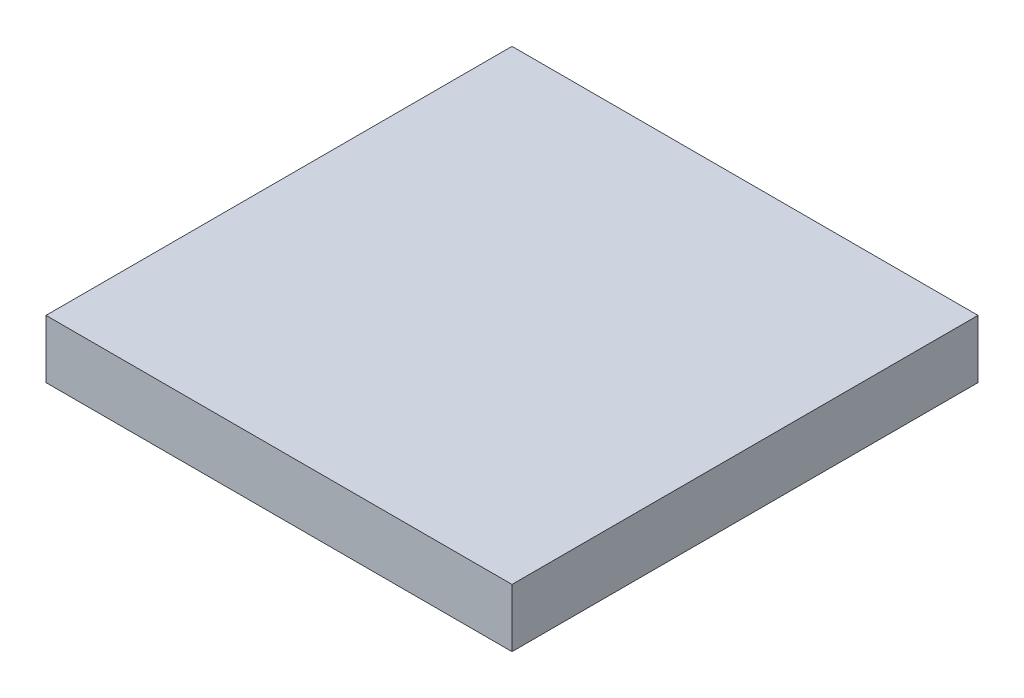
ISO-10303-21;
HEADER;
FILE_DESCRIPTION(('STEP AP214'),'2;1');
FILE_NAME('part.step','',(''),(''),'','','');
FILE_SCHEMA(('AUTOMOTIVE_DESIGN { 1 0 10303 214 1 1 1 1 }'));
ENDSEC;
DATA;
#1=APPLICATION_CONTEXT('core data for automotive mechanical design processes');
#2=APPLICATION_PROTOCOL_DEFINITION('international standard','automotive_design',2000,#1);
#3=PRODUCT_CONTEXT('',#1,'mechanical');
#4=PRODUCT('Part','Part','',(#3));
#5=PRODUCT_RELATED_PRODUCT_CATEGORY('part','',(#4));
#6=PRODUCT_DEFINITION_FORMATION('','',#4);
#7=PRODUCT_DEFINITION_CONTEXT('part definition',#1,'design');
#8=PRODUCT_DEFINITION('design','',#6,#7);
#9=PRODUCT_DEFINITION_SHAPE('','',#8);
#10=(LENGTH_UNIT() NAMED_UNIT(*) SI_UNIT(.MILLI.,.METRE.));
#11=(NAMED_UNIT(*) PLANE_ANGLE_UNIT() SI_UNIT($,.RADIAN.));
#12=(NAMED_UNIT(*) SI_UNIT($,.STERADIAN.) SOLID_ANGLE_UNIT());
#13=UNCERTAINTY_MEASURE_WITH_UNIT(LENGTH_MEASURE(1.E-05),#10,'distance_accuracy_value','');
#14=(GEOMETRIC_REPRESENTATION_CONTEXT(3) GLOBAL_UNCERTAINTY_ASSIGNED_CONTEXT((#13)) GLOBAL_UNIT_ASSIGNED_CONTEXT((#10,
#11,#12)) REPRESENTATION_CONTEXT('',''));
#15=CARTESIAN_POINT('',(0.,0.,0.));
#16=DIRECTION('',(0.,0.,1.));
#17=DIRECTION('',(1.,0.,0.));
#18=AXIS2_PLACEMENT_3D('',#15,#16,#17);
#19=CARTESIAN_POINT('',(10.16,2.54,-10.16));
#20=DIRECTION('',(-1.,0.,0.));
#21=DIRECTION('',(0.,0.,1.));
#22=AXIS2_PLACEMENT_3D('',#19,#20,#21);
#23=PLANE('',#22);
#24=DIRECTION('',(0.,0.,-1.));
#25=VECTOR('',#24,1.);
#26=CARTESIAN_POINT('',(10.16,0.,-10.16));
#27=LINE('',#26,#25);
#28=CARTESIAN_POINT('',(10.16,0.,10.16));
#29=VERTEX_POINT('',#28);
#30=CARTESIAN_POINT('',(10.16,0.,-10.16));
#31=VERTEX_POINT('',#30);
#32=EDGE_CURVE('E94',#29,#31,#27,.T.);
#33=ORIENTED_EDGE('',*,*,#32,.T.);
#34=DIRECTION('',(0.,-1.,0.));
#35=VECTOR('',#34,1.);
#36=CARTESIAN_POINT('',(10.16,2.54,-10.16));
#37=LINE('',#36,#35);
#38=CARTESIAN_POINT('',(10.16,2.54,-10.16));
#39=VERTEX_POINT('',#38);
#40=EDGE_CURVE('E11',#39,#31,#37,.T.);
#41=ORIENTED_EDGE('',*,*,#40,.F.);
#42=DIRECTION('',(0.,0.,-1.));
#43=VECTOR('',#42,1.);
#44=CARTESIAN_POINT('',(10.16,2.54,-10.16));
#45=LINE('',#44,#43);
#46=CARTESIAN_POINT('',(10.16,2.54,10.16));
#47=VERTEX_POINT('',#46);
#48=EDGE_CURVE('E82',#47,#39,#45,.T.);
#49=ORIENTED_EDGE('',*,*,#48,.F.);
#50=DIRECTION('',(0.,-1.,0.));
#51=VECTOR('',#50,1.);
#52=CARTESIAN_POINT('',(10.16,2.54,10.16));
#53=LINE('',#52,#51);
#54=EDGE_CURVE('E90',#47,#29,#53,.T.);
#55=ORIENTED_EDGE('',*,*,#54,.T.);
#56=EDGE_LOOP('',(#33,#41,#49,#55));
#57=FACE_BOUND('',#56,.T.);
#58=ADVANCED_FACE('F31',(#57),#23,.F.);
#59=CARTESIAN_POINT('',(-10.16,2.54,-10.16));
#60=DIRECTION('',(0.,0.,1.));
#61=DIRECTION('',(1.,0.,0.));
#62=AXIS2_PLACEMENT_3D('',#59,#60,#61);
#63=PLANE('',#62);
#64=DIRECTION('',(-1.,0.,0.));
#65=VECTOR('',#64,1.);
#66=CARTESIAN_POINT('',(-10.16,0.,-10.16));
#67=LINE('',#66,#65);
#68=CARTESIAN_POINT('',(-10.16,0.,-10.16));
#69=VERTEX_POINT('',#68);
#70=EDGE_CURVE('E86',#31,#69,#67,.T.);
#71=ORIENTED_EDGE('',*,*,#70,.T.);
#72=DIRECTION('',(0.,-1.,0.));
#73=VECTOR('',#72,1.);
#74=CARTESIAN_POINT('',(-10.16,2.54,-10.16));
#75=LINE('',#74,#73);
#76=CARTESIAN_POINT('',(-10.16,2.54,-10.16));
#77=VERTEX_POINT('',#76);
#78=EDGE_CURVE('E39',#77,#69,#75,.T.);
#79=ORIENTED_EDGE('',*,*,#78,.F.);
#80=DIRECTION('',(-1.,0.,0.));
#81=VECTOR('',#80,1.);
#82=CARTESIAN_POINT('',(-10.16,2.54,-10.16));
#83=LINE('',#82,#81);
#84=EDGE_CURVE('E77',#39,#77,#83,.T.);
#85=ORIENTED_EDGE('',*,*,#84,.F.);
#86=ORIENTED_EDGE('',*,*,#40,.T.);
#87=EDGE_LOOP('',(#71,#79,#85,#86));
#88=FACE_BOUND('',#87,.T.);
#89=ADVANCED_FACE('F85',(#88),#63,.F.);
#90=CARTESIAN_POINT('',(-10.16,2.54,-10.16));
#91=DIRECTION('',(1.,0.,0.));
#92=DIRECTION('',(0.,0.,-1.));
#93=AXIS2_PLACEMENT_3D('',#90,#91,#92);
#94=PLANE('',#93);
#95=DIRECTION('',(0.,0.,1.));
#96=VECTOR('',#95,1.);
#97=CARTESIAN_POINT('',(-10.16,0.,-10.16));
#98=LINE('',#97,#96);
#99=CARTESIAN_POINT('',(-10.16,0.,10.16));
#100=VERTEX_POINT('',#99);
#101=EDGE_CURVE('E64',#69,#100,#98,.T.);
#102=ORIENTED_EDGE('',*,*,#101,.T.);
#103=DIRECTION('',(0.,-1.,0.));
#104=VECTOR('',#103,1.);
#105=CARTESIAN_POINT('',(-10.16,2.54,10.16));
#106=LINE('',#105,#104);
#107=CARTESIAN_POINT('',(-10.16,2.54,10.16));
#108=VERTEX_POINT('',#107);
#109=EDGE_CURVE('E87',#108,#100,#106,.T.);
#110=ORIENTED_EDGE('',*,*,#109,.F.);
#111=DIRECTION('',(0.,0.,1.));
#112=VECTOR('',#111,1.);
#113=CARTESIAN_POINT('',(-10.16,2.54,-10.16));
#114=LINE('',#113,#112);
#115=EDGE_CURVE('E80',#77,#108,#114,.T.);
#116=ORIENTED_EDGE('',*,*,#115,.F.);
#117=ORIENTED_EDGE('',*,*,#78,.T.);
#118=EDGE_LOOP('',(#102,#110,#116,#117));
#119=FACE_BOUND('',#118,.T.);
#120=ADVANCED_FACE('F88',(#119),#94,.F.);
#121=CARTESIAN_POINT('',(-10.16,2.54,10.16));
#122=DIRECTION('',(0.,0.,-1.));
#123=DIRECTION('',(-1.,0.,0.));
#124=AXIS2_PLACEMENT_3D('',#121,#122,#123);
#125=PLANE('',#124);
#126=DIRECTION('',(1.,0.,0.));
#127=VECTOR('',#126,1.);
#128=CARTESIAN_POINT('',(-10.16,0.,10.16));
#129=LINE('',#128,#127);
#130=EDGE_CURVE('E70',#100,#29,#129,.T.);
#131=ORIENTED_EDGE('',*,*,#130,.T.);
#132=ORIENTED_EDGE('',*,*,#54,.F.);
#133=DIRECTION('',(1.,0.,0.));
#134=VECTOR('',#133,1.);
#135=CARTESIAN_POINT('',(-10.16,2.54,10.16));
#136=LINE('',#135,#134);
#137=EDGE_CURVE('E47',#108,#47,#136,.T.);
#138=ORIENTED_EDGE('',*,*,#137,.F.);
#139=ORIENTED_EDGE('',*,*,#109,.T.);
#140=EDGE_LOOP('',(#131,#132,#138,#139));
#141=FACE_BOUND('',#140,.T.);
#142=ADVANCED_FACE('F101',(#141),#125,.F.);
#143=CARTESIAN_POINT('',(10.16,2.54,10.16));
#144=DIRECTION('',(0.,1.,0.));
#145=DIRECTION('',(0.,0.,1.));
#146=AXIS2_PLACEMENT_3D('',#143,#144,#145);
#147=PLANE('',#146);
#148=ORIENTED_EDGE('',*,*,#48,.T.);
#149=ORIENTED_EDGE('',*,*,#84,.T.);
#150=ORIENTED_EDGE('',*,*,#115,.T.);
#151=ORIENTED_EDGE('',*,*,#137,.T.);
#152=EDGE_LOOP('',(#148,#149,#150,#151));
#153=FACE_BOUND('',#152,.T.);
#154=ADVANCED_FACE('F78',(#153),#147,.T.);
#155=CARTESIAN_POINT('',(10.16,0.,10.16));
#156=DIRECTION('',(0.,1.,0.));
#157=DIRECTION('',(0.,0.,1.));
#158=AXIS2_PLACEMENT_3D('',#155,#156,#157);
#159=PLANE('',#158);
#160=ORIENTED_EDGE('',*,*,#32,.F.);
#161=ORIENTED_EDGE('',*,*,#130,.F.);
#162=ORIENTED_EDGE('',*,*,#101,.F.);
#163=ORIENTED_EDGE('',*,*,#70,.F.);
#164=EDGE_LOOP('',(#160,#161,#162,#163));
#165=FACE_BOUND('',#164,.T.);
#166=ADVANCED_FACE('F104',(#165),#159,.F.);
#167=CLOSED_SHELL('',(#58,#89,#120,#142,#154,#166));
#168=MANIFOLD_SOLID_BREP('B2',#167);
#169=ADVANCED_BREP_SHAPE_REPRESENTATION('',(#18,#168),#14);
#170=SHAPE_DEFINITION_REPRESENTATION(#9,#169);
ENDSEC;
END-ISO-10303-21;
